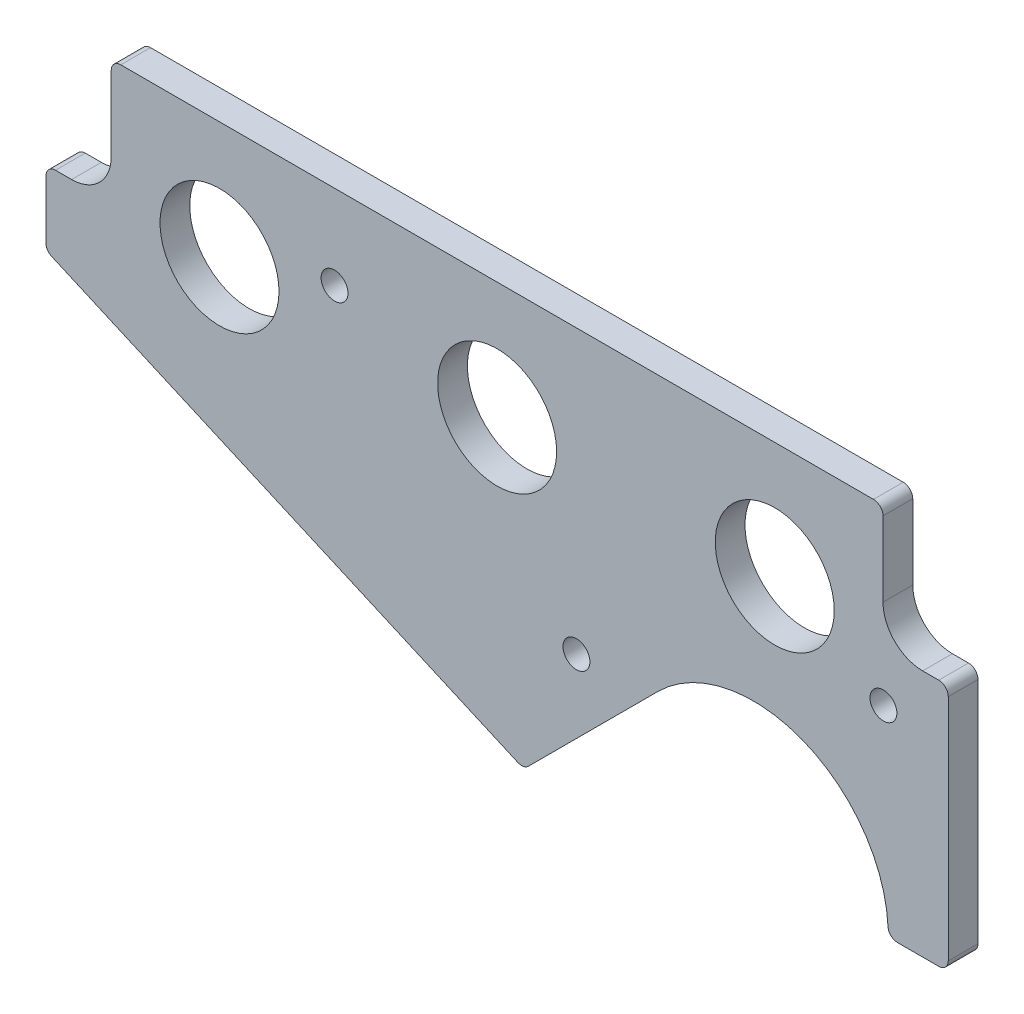
ISO-10303-21;
HEADER;
FILE_DESCRIPTION(('STEP AP214'),'2;1');
FILE_NAME('part.step','',(''),(''),'','','');
FILE_SCHEMA(('AUTOMOTIVE_DESIGN { 1 0 10303 214 1 1 1 1 }'));
ENDSEC;
DATA;
#1=APPLICATION_CONTEXT('core data for automotive mechanical design processes');
#2=APPLICATION_PROTOCOL_DEFINITION('international standard','automotive_design',2000,#1);
#3=PRODUCT_CONTEXT('',#1,'mechanical');
#4=PRODUCT('Part','Part','',(#3));
#5=PRODUCT_RELATED_PRODUCT_CATEGORY('part','',(#4));
#6=PRODUCT_DEFINITION_FORMATION('','',#4);
#7=PRODUCT_DEFINITION_CONTEXT('part definition',#1,'design');
#8=PRODUCT_DEFINITION('design','',#6,#7);
#9=PRODUCT_DEFINITION_SHAPE('','',#8);
#10=(LENGTH_UNIT() NAMED_UNIT(*) SI_UNIT(.MILLI.,.METRE.));
#11=(NAMED_UNIT(*) PLANE_ANGLE_UNIT() SI_UNIT($,.RADIAN.));
#12=(NAMED_UNIT(*) SI_UNIT($,.STERADIAN.) SOLID_ANGLE_UNIT());
#13=UNCERTAINTY_MEASURE_WITH_UNIT(LENGTH_MEASURE(1.E-05),#10,'distance_accuracy_value','');
#14=(GEOMETRIC_REPRESENTATION_CONTEXT(3) GLOBAL_UNCERTAINTY_ASSIGNED_CONTEXT((#13)) GLOBAL_UNIT_ASSIGNED_CONTEXT((#10,
#11,#12)) REPRESENTATION_CONTEXT('',''));
#15=CARTESIAN_POINT('',(0.,0.,0.));
#16=DIRECTION('',(0.,0.,1.));
#17=DIRECTION('',(1.,0.,0.));
#18=AXIS2_PLACEMENT_3D('',#15,#16,#17);
#19=CARTESIAN_POINT('',(-842.127056946519,5944.5822876227,-29.6686860778708));
#20=DIRECTION('',(0.,0.,-1.));
#21=DIRECTION('',(-1.,0.,0.));
#22=AXIS2_PLACEMENT_3D('',#19,#20,#21);
#23=CYLINDRICAL_SURFACE('',#22,1.52399999999986);
#24=CARTESIAN_POINT('',(-842.127056946519,5944.5822876227,-34.4311860778708));
#25=DIRECTION('',(0.,0.,1.));
#26=DIRECTION('',(1.,0.,0.));
#27=AXIS2_PLACEMENT_3D('',#24,#25,#26);
#28=CIRCLE('',#27,1.52399999999986);
#29=CARTESIAN_POINT('',(-840.603056946519,5944.5822876227,-34.4311860778708));
#30=VERTEX_POINT('',#29);
#31=CARTESIAN_POINT('',(-842.127056946519,5946.1062876227,-34.4311860778708));
#32=VERTEX_POINT('',#31);
#33=EDGE_CURVE('E206',#30,#32,#28,.T.);
#34=ORIENTED_EDGE('',*,*,#33,.T.);
#35=DIRECTION('',(0.,0.,-1.));
#36=VECTOR('',#35,1.);
#37=CARTESIAN_POINT('',(-842.127056946519,5946.1062876227,-29.6686860778708));
#38=LINE('',#37,#36);
#39=CARTESIAN_POINT('',(-842.127056946519,5946.1062876227,-29.6686860778708));
#40=VERTEX_POINT('',#39);
#41=EDGE_CURVE('E11',#40,#32,#38,.T.);
#42=ORIENTED_EDGE('',*,*,#41,.F.);
#43=CARTESIAN_POINT('',(-842.127056946519,5944.5822876227,-29.6686860778708));
#44=DIRECTION('',(0.,0.,1.));
#45=DIRECTION('',(1.,0.,0.));
#46=AXIS2_PLACEMENT_3D('',#43,#44,#45);
#47=CIRCLE('',#46,1.52399999999986);
#48=CARTESIAN_POINT('',(-840.603056946519,5944.5822876227,-29.6686860778708));
#49=VERTEX_POINT('',#48);
#50=EDGE_CURVE('E247',#49,#40,#47,.T.);
#51=ORIENTED_EDGE('',*,*,#50,.F.);
#52=DIRECTION('',(0.,0.,-1.));
#53=VECTOR('',#52,1.);
#54=CARTESIAN_POINT('',(-840.603056946519,5944.5822876227,-29.6686860778708));
#55=LINE('',#54,#53);
#56=EDGE_CURVE('E202',#49,#30,#55,.T.);
#57=ORIENTED_EDGE('',*,*,#56,.T.);
#58=EDGE_LOOP('',(#34,#42,#51,#57));
#59=FACE_BOUND('',#58,.T.);
#60=ADVANCED_FACE('F32',(#59),#23,.T.);
#61=CARTESIAN_POINT('',(-842.127056946519,5946.1062876227,-29.6686860778708));
#62=DIRECTION('',(0.,-1.,0.));
#63=DIRECTION('',(0.,0.,-1.));
#64=AXIS2_PLACEMENT_3D('',#61,#62,#63);
#65=PLANE('',#64);
#66=DIRECTION('',(-1.,0.,0.));
#67=VECTOR('',#66,1.);
#68=CARTESIAN_POINT('',(-842.127056946519,5946.1062876227,-34.4311860778708));
#69=LINE('',#68,#67);
#70=CARTESIAN_POINT('',(-962.650056946519,5946.1062876227,-34.4311860778708));
#71=VERTEX_POINT('',#70);
#72=EDGE_CURVE('E209',#32,#71,#69,.T.);
#73=ORIENTED_EDGE('',*,*,#72,.T.);
#74=DIRECTION('',(0.,0.,-1.));
#75=VECTOR('',#74,1.);
#76=CARTESIAN_POINT('',(-962.650056946519,5946.1062876227,-29.6686860778708));
#77=LINE('',#76,#75);
#78=CARTESIAN_POINT('',(-962.650056946519,5946.1062876227,-29.6686860778708));
#79=VERTEX_POINT('',#78);
#80=EDGE_CURVE('E40',#79,#71,#77,.T.);
#81=ORIENTED_EDGE('',*,*,#80,.F.);
#82=DIRECTION('',(-1.,0.,0.));
#83=VECTOR('',#82,1.);
#84=CARTESIAN_POINT('',(-842.127056946519,5946.1062876227,-29.6686860778708));
#85=LINE('',#84,#83);
#86=EDGE_CURVE('E130',#40,#79,#85,.T.);
#87=ORIENTED_EDGE('',*,*,#86,.F.);
#88=ORIENTED_EDGE('',*,*,#41,.T.);
#89=EDGE_LOOP('',(#73,#81,#87,#88));
#90=FACE_BOUND('',#89,.T.);
#91=ADVANCED_FACE('F371',(#90),#65,.F.);
#92=CARTESIAN_POINT('',(-962.650056946519,5944.5822876227,-29.6686860778708));
#93=DIRECTION('',(0.,0.,-1.));
#94=DIRECTION('',(-1.,0.,0.));
#95=AXIS2_PLACEMENT_3D('',#92,#93,#94);
#96=CYLINDRICAL_SURFACE('',#95,1.52400000000052);
#97=CARTESIAN_POINT('',(-962.650056946519,5944.5822876227,-34.4311860778708));
#98=DIRECTION('',(0.,0.,1.));
#99=DIRECTION('',(1.,0.,0.));
#100=AXIS2_PLACEMENT_3D('',#97,#98,#99);
#101=CIRCLE('',#100,1.52400000000052);
#102=CARTESIAN_POINT('',(-964.174056946519,5944.5822876227,-34.4311860778708));
#103=VERTEX_POINT('',#102);
#104=EDGE_CURVE('E212',#71,#103,#101,.T.);
#105=ORIENTED_EDGE('',*,*,#104,.T.);
#106=DIRECTION('',(0.,0.,-1.));
#107=VECTOR('',#106,1.);
#108=CARTESIAN_POINT('',(-964.174056946519,5944.5822876227,-29.6686860778708));
#109=LINE('',#108,#107);
#110=CARTESIAN_POINT('',(-964.174056946519,5944.5822876227,-29.6686860778708));
#111=VERTEX_POINT('',#110);
#112=EDGE_CURVE('E293',#111,#103,#109,.T.);
#113=ORIENTED_EDGE('',*,*,#112,.F.);
#114=CARTESIAN_POINT('',(-962.650056946519,5944.5822876227,-29.6686860778708));
#115=DIRECTION('',(0.,0.,1.));
#116=DIRECTION('',(1.,0.,0.));
#117=AXIS2_PLACEMENT_3D('',#114,#115,#116);
#118=CIRCLE('',#117,1.52400000000052);
#119=EDGE_CURVE('E301',#79,#111,#118,.T.);
#120=ORIENTED_EDGE('',*,*,#119,.F.);
#121=ORIENTED_EDGE('',*,*,#80,.T.);
#122=EDGE_LOOP('',(#105,#113,#120,#121));
#123=FACE_BOUND('',#122,.T.);
#124=ADVANCED_FACE('F299',(#123),#96,.T.);
#125=CARTESIAN_POINT('',(-964.174056946519,5944.5822876227,-29.6686860778708));
#126=DIRECTION('',(1.,0.,0.));
#127=DIRECTION('',(0.,1.,0.));
#128=AXIS2_PLACEMENT_3D('',#125,#126,#127);
#129=PLANE('',#128);
#130=DIRECTION('',(0.,-1.,0.));
#131=VECTOR('',#130,1.);
#132=CARTESIAN_POINT('',(-964.174056946519,5944.5822876227,-34.4311860778708));
#133=LINE('',#132,#131);
#134=CARTESIAN_POINT('',(-964.174056946519,5932.6125376227,-34.4311860778708));
#135=VERTEX_POINT('',#134);
#136=EDGE_CURVE('E214',#103,#135,#133,.T.);
#137=ORIENTED_EDGE('',*,*,#136,.T.);
#138=DIRECTION('',(0.,0.,-1.));
#139=VECTOR('',#138,1.);
#140=CARTESIAN_POINT('',(-964.174056946519,5932.6125376227,-29.6686860778708));
#141=LINE('',#140,#139);
#142=CARTESIAN_POINT('',(-964.174056946519,5932.6125376227,-29.6686860778708));
#143=VERTEX_POINT('',#142);
#144=EDGE_CURVE('E290',#143,#135,#141,.T.);
#145=ORIENTED_EDGE('',*,*,#144,.F.);
#146=DIRECTION('',(0.,-1.,0.));
#147=VECTOR('',#146,1.);
#148=CARTESIAN_POINT('',(-964.174056946519,5944.5822876227,-29.6686860778708));
#149=LINE('',#148,#147);
#150=EDGE_CURVE('E319',#111,#143,#149,.T.);
#151=ORIENTED_EDGE('',*,*,#150,.F.);
#152=ORIENTED_EDGE('',*,*,#112,.T.);
#153=EDGE_LOOP('',(#137,#145,#151,#152));
#154=FACE_BOUND('',#153,.T.);
#155=ADVANCED_FACE('F310',(#154),#129,.F.);
#156=CARTESIAN_POINT('',(-970.524056946519,5932.6125376227,-29.6686860778708));
#157=DIRECTION('',(0.,0.,-1.));
#158=DIRECTION('',(-1.,0.,0.));
#159=AXIS2_PLACEMENT_3D('',#156,#157,#158);
#160=CYLINDRICAL_SURFACE('',#159,6.35000000000008);
#161=CARTESIAN_POINT('',(-970.524056946519,5932.6125376227,-34.4311860778708));
#162=DIRECTION('',(0.,0.,-1.));
#163=DIRECTION('',(1.,0.,0.));
#164=AXIS2_PLACEMENT_3D('',#161,#162,#163);
#165=CIRCLE('',#164,6.35000000000008);
#166=CARTESIAN_POINT('',(-970.524056946519,5926.2625376227,-34.4311860778708));
#167=VERTEX_POINT('',#166);
#168=EDGE_CURVE('E216',#135,#167,#165,.T.);
#169=ORIENTED_EDGE('',*,*,#168,.T.);
#170=DIRECTION('',(0.,0.,-1.));
#171=VECTOR('',#170,1.);
#172=CARTESIAN_POINT('',(-970.524056946519,5926.2625376227,-29.6686860778708));
#173=LINE('',#172,#171);
#174=CARTESIAN_POINT('',(-970.524056946519,5926.2625376227,-29.6686860778708));
#175=VERTEX_POINT('',#174);
#176=EDGE_CURVE('E287',#175,#167,#173,.T.);
#177=ORIENTED_EDGE('',*,*,#176,.F.);
#178=CARTESIAN_POINT('',(-970.524056946519,5932.6125376227,-29.6686860778708));
#179=DIRECTION('',(0.,0.,-1.));
#180=DIRECTION('',(1.,0.,0.));
#181=AXIS2_PLACEMENT_3D('',#178,#179,#180);
#182=CIRCLE('',#181,6.35000000000008);
#183=EDGE_CURVE('E316',#143,#175,#182,.T.);
#184=ORIENTED_EDGE('',*,*,#183,.F.);
#185=ORIENTED_EDGE('',*,*,#144,.T.);
#186=EDGE_LOOP('',(#169,#177,#184,#185));
#187=FACE_BOUND('',#186,.T.);
#188=ADVANCED_FACE('F314',(#187),#160,.F.);
#189=CARTESIAN_POINT('',(-970.524056946519,5926.2625376227,-29.6686860778708));
#190=DIRECTION('',(0.,-1.,0.));
#191=DIRECTION('',(0.,0.,-1.));
#192=AXIS2_PLACEMENT_3D('',#189,#190,#191);
#193=PLANE('',#192);
#194=DIRECTION('',(-1.,0.,0.));
#195=VECTOR('',#194,1.);
#196=CARTESIAN_POINT('',(-970.524056946519,5926.2625376227,-34.4311860778708));
#197=LINE('',#196,#195);
#198=CARTESIAN_POINT('',(-973.095806946519,5926.2625376227,-34.4311860778708));
#199=VERTEX_POINT('',#198);
#200=EDGE_CURVE('E218',#167,#199,#197,.T.);
#201=ORIENTED_EDGE('',*,*,#200,.T.);
#202=DIRECTION('',(0.,0.,-1.));
#203=VECTOR('',#202,1.);
#204=CARTESIAN_POINT('',(-973.095806946519,5926.2625376227,-29.6686860778708));
#205=LINE('',#204,#203);
#206=CARTESIAN_POINT('',(-973.095806946519,5926.2625376227,-29.6686860778708));
#207=VERTEX_POINT('',#206);
#208=EDGE_CURVE('E284',#207,#199,#205,.T.);
#209=ORIENTED_EDGE('',*,*,#208,.F.);
#210=DIRECTION('',(-1.,0.,0.));
#211=VECTOR('',#210,1.);
#212=CARTESIAN_POINT('',(-970.524056946519,5926.2625376227,-29.6686860778708));
#213=LINE('',#212,#211);
#214=EDGE_CURVE('E318',#175,#207,#213,.T.);
#215=ORIENTED_EDGE('',*,*,#214,.F.);
#216=ORIENTED_EDGE('',*,*,#176,.T.);
#217=EDGE_LOOP('',(#201,#209,#215,#216));
#218=FACE_BOUND('',#217,.T.);
#219=ADVANCED_FACE('F384',(#218),#193,.F.);
#220=CARTESIAN_POINT('',(-973.095806946519,5924.7385376227,-29.6686860778708));
#221=DIRECTION('',(0.,0.,-1.));
#222=DIRECTION('',(-1.,0.,0.));
#223=AXIS2_PLACEMENT_3D('',#220,#221,#222);
#224=CYLINDRICAL_SURFACE('',#223,1.52399999999986);
#225=CARTESIAN_POINT('',(-973.095806946519,5924.7385376227,-34.4311860778708));
#226=DIRECTION('',(0.,0.,1.));
#227=DIRECTION('',(1.,0.,0.));
#228=AXIS2_PLACEMENT_3D('',#225,#226,#227);
#229=CIRCLE('',#228,1.52399999999986);
#230=CARTESIAN_POINT('',(-974.619806946519,5924.7385376227,-34.4311860778708));
#231=VERTEX_POINT('',#230);
#232=EDGE_CURVE('E220',#199,#231,#229,.T.);
#233=ORIENTED_EDGE('',*,*,#232,.T.);
#234=DIRECTION('',(0.,0.,-1.));
#235=VECTOR('',#234,1.);
#236=CARTESIAN_POINT('',(-974.619806946519,5924.7385376227,-29.6686860778708));
#237=LINE('',#236,#235);
#238=CARTESIAN_POINT('',(-974.619806946519,5924.7385376227,-29.6686860778708));
#239=VERTEX_POINT('',#238);
#240=EDGE_CURVE('E281',#239,#231,#237,.T.);
#241=ORIENTED_EDGE('',*,*,#240,.F.);
#242=CARTESIAN_POINT('',(-973.095806946519,5924.7385376227,-29.6686860778708));
#243=DIRECTION('',(0.,0.,1.));
#244=DIRECTION('',(1.,0.,0.));
#245=AXIS2_PLACEMENT_3D('',#242,#243,#244);
#246=CIRCLE('',#245,1.52399999999986);
#247=EDGE_CURVE('E321',#207,#239,#246,.T.);
#248=ORIENTED_EDGE('',*,*,#247,.F.);
#249=ORIENTED_EDGE('',*,*,#208,.T.);
#250=EDGE_LOOP('',(#233,#241,#248,#249));
#251=FACE_BOUND('',#250,.T.);
#252=ADVANCED_FACE('F387',(#251),#224,.T.);
#253=CARTESIAN_POINT('',(-974.619806946519,5924.7385376227,-29.6686860778708));
#254=DIRECTION('',(1.,0.,0.));
#255=DIRECTION('',(0.,1.,0.));
#256=AXIS2_PLACEMENT_3D('',#253,#254,#255);
#257=PLANE('',#256);
#258=DIRECTION('',(0.,-1.,0.));
#259=VECTOR('',#258,1.);
#260=CARTESIAN_POINT('',(-974.619806946519,5924.7385376227,-34.4311860778708));
#261=LINE('',#260,#259);
#262=CARTESIAN_POINT('',(-974.619806946519,5915.39241590532,-34.4311860778708));
#263=VERTEX_POINT('',#262);
#264=EDGE_CURVE('E222',#231,#263,#261,.T.);
#265=ORIENTED_EDGE('',*,*,#264,.T.);
#266=DIRECTION('',(0.,0.,-1.));
#267=VECTOR('',#266,1.);
#268=CARTESIAN_POINT('',(-974.619806946519,5915.39241590532,-29.6686860778708));
#269=LINE('',#268,#267);
#270=CARTESIAN_POINT('',(-974.619806946519,5915.39241590532,-29.6686860778708));
#271=VERTEX_POINT('',#270);
#272=EDGE_CURVE('E278',#271,#263,#269,.T.);
#273=ORIENTED_EDGE('',*,*,#272,.F.);
#274=DIRECTION('',(0.,-1.,0.));
#275=VECTOR('',#274,1.);
#276=CARTESIAN_POINT('',(-974.619806946519,5924.7385376227,-29.6686860778708));
#277=LINE('',#276,#275);
#278=EDGE_CURVE('E327',#239,#271,#277,.T.);
#279=ORIENTED_EDGE('',*,*,#278,.F.);
#280=ORIENTED_EDGE('',*,*,#240,.T.);
#281=EDGE_LOOP('',(#265,#273,#279,#280));
#282=FACE_BOUND('',#281,.T.);
#283=ADVANCED_FACE('F391',(#282),#257,.F.);
#284=CARTESIAN_POINT('',(-973.095806946519,5915.39241590532,-29.6686860778708));
#285=DIRECTION('',(0.,0.,-1.));
#286=DIRECTION('',(-1.,0.,0.));
#287=AXIS2_PLACEMENT_3D('',#284,#285,#286);
#288=CYLINDRICAL_SURFACE('',#287,1.52400000000021);
#289=CARTESIAN_POINT('',(-973.095806946519,5915.39241590532,-34.4311860778708));
#290=DIRECTION('',(0.,0.,1.));
#291=DIRECTION('',(1.,0.,0.));
#292=AXIS2_PLACEMENT_3D('',#289,#290,#291);
#293=CIRCLE('',#292,1.52400000000021);
#294=CARTESIAN_POINT('',(-973.70958059466,5913.9974757959,-34.4311860778708));
#295=VERTEX_POINT('',#294);
#296=EDGE_CURVE('E224',#263,#295,#293,.T.);
#297=ORIENTED_EDGE('',*,*,#296,.T.);
#298=DIRECTION('',(0.,0.,-1.));
#299=VECTOR('',#298,1.);
#300=CARTESIAN_POINT('',(-973.70958059466,5913.9974757959,-29.6686860778708));
#301=LINE('',#300,#299);
#302=CARTESIAN_POINT('',(-973.70958059466,5913.9974757959,-29.6686860778708));
#303=VERTEX_POINT('',#302);
#304=EDGE_CURVE('E275',#303,#295,#301,.T.);
#305=ORIENTED_EDGE('',*,*,#304,.F.);
#306=CARTESIAN_POINT('',(-973.095806946519,5915.39241590532,-29.6686860778708));
#307=DIRECTION('',(0.,0.,1.));
#308=DIRECTION('',(1.,0.,0.));
#309=AXIS2_PLACEMENT_3D('',#306,#307,#308);
#310=CIRCLE('',#309,1.52400000000021);
#311=EDGE_CURVE('E329',#271,#303,#310,.T.);
#312=ORIENTED_EDGE('',*,*,#311,.F.);
#313=ORIENTED_EDGE('',*,*,#272,.T.);
#314=EDGE_LOOP('',(#297,#305,#312,#313));
#315=FACE_BOUND('',#314,.T.);
#316=ADVANCED_FACE('F395',(#315),#288,.T.);
#317=CARTESIAN_POINT('',(-973.70958059466,5913.9974757959,-29.6686860778708));
#318=DIRECTION('',(0.40273861426601,0.915315032422768,0.));
#319=DIRECTION('',(-0.915315032422768,0.40273861426601,0.));
#320=AXIS2_PLACEMENT_3D('',#317,#318,#319);
#321=PLANE('',#320);
#322=DIRECTION('',(0.915315032422768,-0.40273861426601,0.));
#323=VECTOR('',#322,1.);
#324=CARTESIAN_POINT('',(-973.70958059466,5913.9974757959,-34.4311860778708));
#325=LINE('',#324,#323);
#326=CARTESIAN_POINT('',(-899.073125037771,5881.15743535087,-34.4311860778708));
#327=VERTEX_POINT('',#326);
#328=EDGE_CURVE('E226',#295,#327,#325,.T.);
#329=ORIENTED_EDGE('',*,*,#328,.T.);
#330=DIRECTION('',(0.,0.,-1.));
#331=VECTOR('',#330,1.);
#332=CARTESIAN_POINT('',(-899.073125037771,5881.15743535087,-29.6686860778708));
#333=LINE('',#332,#331);
#334=CARTESIAN_POINT('',(-899.073125037771,5881.15743535087,-29.6686860778708));
#335=VERTEX_POINT('',#334);
#336=EDGE_CURVE('E272',#335,#327,#333,.T.);
#337=ORIENTED_EDGE('',*,*,#336,.F.);
#338=DIRECTION('',(0.915315032422768,-0.40273861426601,0.));
#339=VECTOR('',#338,1.);
#340=CARTESIAN_POINT('',(-973.70958059466,5913.9974757959,-29.6686860778708));
#341=LINE('',#340,#339);
#342=EDGE_CURVE('E331',#303,#335,#341,.T.);
#343=ORIENTED_EDGE('',*,*,#342,.F.);
#344=ORIENTED_EDGE('',*,*,#304,.T.);
#345=EDGE_LOOP('',(#329,#337,#343,#344));
#346=FACE_BOUND('',#345,.T.);
#347=ADVANCED_FACE('F399',(#346),#321,.F.);
#348=CARTESIAN_POINT('',(-898.459351389629,5882.55237546029,-29.6686860778708));
#349=DIRECTION('',(0.,0.,-1.));
#350=DIRECTION('',(-1.,0.,0.));
#351=AXIS2_PLACEMENT_3D('',#348,#349,#350);
#352=CYLINDRICAL_SURFACE('',#351,1.52399999999978);
#353=CARTESIAN_POINT('',(-898.459351389629,5882.55237546029,-34.4311860778708));
#354=DIRECTION('',(0.,0.,1.));
#355=DIRECTION('',(1.,0.,0.));
#356=AXIS2_PLACEMENT_3D('',#353,#354,#355);
#357=CIRCLE('',#356,1.52399999999978);
#358=CARTESIAN_POINT('',(-897.381720655101,5881.47474472576,-34.4311860778708));
#359=VERTEX_POINT('',#358);
#360=EDGE_CURVE('E228',#327,#359,#357,.T.);
#361=ORIENTED_EDGE('',*,*,#360,.T.);
#362=DIRECTION('',(0.,0.,-1.));
#363=VECTOR('',#362,1.);
#364=CARTESIAN_POINT('',(-897.381720655101,5881.47474472576,-29.6686860778708));
#365=LINE('',#364,#363);
#366=CARTESIAN_POINT('',(-897.381720655101,5881.47474472576,-29.6686860778708));
#367=VERTEX_POINT('',#366);
#368=EDGE_CURVE('E269',#367,#359,#365,.T.);
#369=ORIENTED_EDGE('',*,*,#368,.F.);
#370=CARTESIAN_POINT('',(-898.459351389629,5882.55237546029,-29.6686860778708));
#371=DIRECTION('',(0.,0.,1.));
#372=DIRECTION('',(1.,0.,0.));
#373=AXIS2_PLACEMENT_3D('',#370,#371,#372);
#374=CIRCLE('',#373,1.52399999999978);
#375=EDGE_CURVE('E333',#335,#367,#374,.T.);
#376=ORIENTED_EDGE('',*,*,#375,.F.);
#377=ORIENTED_EDGE('',*,*,#336,.T.);
#378=EDGE_LOOP('',(#361,#369,#376,#377));
#379=FACE_BOUND('',#378,.T.);
#380=ADVANCED_FACE('F403',(#379),#352,.T.);
#381=CARTESIAN_POINT('',(-897.381720655101,5881.47474472576,-29.6686860778708));
#382=DIRECTION('',(-0.707106781186546,0.707106781186549,0.));
#383=DIRECTION('',(-0.707106781186549,-0.707106781186546,0.));
#384=AXIS2_PLACEMENT_3D('',#381,#382,#383);
#385=PLANE('',#384);
#386=DIRECTION('',(0.70710678118655,0.707106781186546,0.));
#387=VECTOR('',#386,1.);
#388=CARTESIAN_POINT('',(-897.381720655101,5881.47474472576,-34.4311860778708));
#389=LINE('',#388,#387);
#390=CARTESIAN_POINT('',(-876.633992352336,5902.22247302852,-34.4311860778708));
#391=VERTEX_POINT('',#390);
#392=EDGE_CURVE('E230',#359,#391,#389,.T.);
#393=ORIENTED_EDGE('',*,*,#392,.T.);
#394=DIRECTION('',(0.,0.,-1.));
#395=VECTOR('',#394,1.);
#396=CARTESIAN_POINT('',(-876.633992352336,5902.22247302852,-29.6686860778708));
#397=LINE('',#396,#395);
#398=CARTESIAN_POINT('',(-876.633992352336,5902.22247302852,-29.6686860778708));
#399=VERTEX_POINT('',#398);
#400=EDGE_CURVE('E266',#399,#391,#397,.T.);
#401=ORIENTED_EDGE('',*,*,#400,.F.);
#402=DIRECTION('',(0.70710678118655,0.707106781186546,0.));
#403=VECTOR('',#402,1.);
#404=CARTESIAN_POINT('',(-897.381720655101,5881.47474472576,-29.6686860778708));
#405=LINE('',#404,#403);
#406=EDGE_CURVE('E335',#367,#399,#405,.T.);
#407=ORIENTED_EDGE('',*,*,#406,.F.);
#408=ORIENTED_EDGE('',*,*,#368,.T.);
#409=EDGE_LOOP('',(#393,#401,#407,#408));
#410=FACE_BOUND('',#409,.T.);
#411=ADVANCED_FACE('F407',(#410),#385,.F.);
#412=CARTESIAN_POINT('',(-861.367556946519,5886.9560376227,-29.6686860778708));
#413=DIRECTION('',(0.,0.,-1.));
#414=DIRECTION('',(-1.,0.,0.));
#415=AXIS2_PLACEMENT_3D('',#412,#413,#414);
#416=CYLINDRICAL_SURFACE('',#415,21.5899999999999);
#417=CARTESIAN_POINT('',(-861.367556946519,5886.9560376227,-34.4311860778708));
#418=DIRECTION('',(0.,0.,-1.));
#419=DIRECTION('',(1.,0.,0.));
#420=AXIS2_PLACEMENT_3D('',#417,#418,#419);
#421=CIRCLE('',#420,21.5899999999999);
#422=CARTESIAN_POINT('',(-839.803970731283,5888.02367498534,-34.4311860778708));
#423=VERTEX_POINT('',#422);
#424=EDGE_CURVE('E232',#391,#423,#421,.T.);
#425=ORIENTED_EDGE('',*,*,#424,.T.);
#426=DIRECTION('',(0.,0.,-1.));
#427=VECTOR('',#426,1.);
#428=CARTESIAN_POINT('',(-839.803970731283,5888.02367498534,-29.6686860778708));
#429=LINE('',#428,#427);
#430=CARTESIAN_POINT('',(-839.803970731283,5888.02367498534,-29.6686860778708));
#431=VERTEX_POINT('',#430);
#432=EDGE_CURVE('E263',#431,#423,#429,.T.);
#433=ORIENTED_EDGE('',*,*,#432,.F.);
#434=CARTESIAN_POINT('',(-861.367556946519,5886.9560376227,-29.6686860778708));
#435=DIRECTION('',(0.,0.,-1.));
#436=DIRECTION('',(1.,0.,0.));
#437=AXIS2_PLACEMENT_3D('',#434,#435,#436);
#438=CIRCLE('',#437,21.5899999999999);
#439=EDGE_CURVE('E337',#399,#431,#438,.T.);
#440=ORIENTED_EDGE('',*,*,#439,.F.);
#441=ORIENTED_EDGE('',*,*,#400,.T.);
#442=EDGE_LOOP('',(#425,#433,#440,#441));
#443=FACE_BOUND('',#442,.T.);
#444=ADVANCED_FACE('F411',(#443),#416,.F.);
#445=CARTESIAN_POINT('',(-838.281835233737,5888.0990376227,-29.6686860778708));
#446=DIRECTION('',(0.,0.,-1.));
#447=DIRECTION('',(-1.,0.,0.));
#448=AXIS2_PLACEMENT_3D('',#445,#446,#447);
#449=CYLINDRICAL_SURFACE('',#448,1.52399999999995);
#450=CARTESIAN_POINT('',(-838.281835233737,5888.0990376227,-34.4311860778708));
#451=DIRECTION('',(0.,0.,1.));
#452=DIRECTION('',(1.,0.,0.));
#453=AXIS2_PLACEMENT_3D('',#450,#451,#452);
#454=CIRCLE('',#453,1.52399999999995);
#455=CARTESIAN_POINT('',(-838.281835233737,5886.5750376227,-34.4311860778708));
#456=VERTEX_POINT('',#455);
#457=EDGE_CURVE('E234',#423,#456,#454,.T.);
#458=ORIENTED_EDGE('',*,*,#457,.T.);
#459=DIRECTION('',(0.,0.,-1.));
#460=VECTOR('',#459,1.);
#461=CARTESIAN_POINT('',(-838.281835233737,5886.5750376227,-29.6686860778708));
#462=LINE('',#461,#460);
#463=CARTESIAN_POINT('',(-838.281835233737,5886.5750376227,-29.6686860778708));
#464=VERTEX_POINT('',#463);
#465=EDGE_CURVE('E260',#464,#456,#462,.T.);
#466=ORIENTED_EDGE('',*,*,#465,.F.);
#467=CARTESIAN_POINT('',(-838.281835233737,5888.0990376227,-29.6686860778708));
#468=DIRECTION('',(0.,0.,1.));
#469=DIRECTION('',(1.,0.,0.));
#470=AXIS2_PLACEMENT_3D('',#467,#468,#469);
#471=CIRCLE('',#470,1.52399999999995);
#472=EDGE_CURVE('E339',#431,#464,#471,.T.);
#473=ORIENTED_EDGE('',*,*,#472,.F.);
#474=ORIENTED_EDGE('',*,*,#432,.T.);
#475=EDGE_LOOP('',(#458,#466,#473,#474));
#476=FACE_BOUND('',#475,.T.);
#477=ADVANCED_FACE('F415',(#476),#449,.T.);
#478=CARTESIAN_POINT('',(-838.281835233737,5886.5750376227,-29.6686860778708));
#479=DIRECTION('',(0.,1.,0.));
#480=DIRECTION('',(0.,0.,1.));
#481=AXIS2_PLACEMENT_3D('',#478,#479,#480);
#482=PLANE('',#481);
#483=DIRECTION('',(1.,0.,0.));
#484=VECTOR('',#483,1.);
#485=CARTESIAN_POINT('',(-838.281835233737,5886.5750376227,-34.4311860778708));
#486=LINE('',#485,#484);
#487=CARTESIAN_POINT('',(-831.681306946519,5886.5750376227,-34.4311860778708));
#488=VERTEX_POINT('',#487);
#489=EDGE_CURVE('E236',#456,#488,#486,.T.);
#490=ORIENTED_EDGE('',*,*,#489,.T.);
#491=DIRECTION('',(0.,0.,-1.));
#492=VECTOR('',#491,1.);
#493=CARTESIAN_POINT('',(-831.681306946519,5886.5750376227,-29.6686860778708));
#494=LINE('',#493,#492);
#495=CARTESIAN_POINT('',(-831.681306946519,5886.5750376227,-29.6686860778708));
#496=VERTEX_POINT('',#495);
#497=EDGE_CURVE('E257',#496,#488,#494,.T.);
#498=ORIENTED_EDGE('',*,*,#497,.F.);
#499=DIRECTION('',(1.,0.,0.));
#500=VECTOR('',#499,1.);
#501=CARTESIAN_POINT('',(-838.281835233737,5886.5750376227,-29.6686860778708));
#502=LINE('',#501,#500);
#503=EDGE_CURVE('E341',#464,#496,#502,.T.);
#504=ORIENTED_EDGE('',*,*,#503,.F.);
#505=ORIENTED_EDGE('',*,*,#465,.T.);
#506=EDGE_LOOP('',(#490,#498,#504,#505));
#507=FACE_BOUND('',#506,.T.);
#508=ADVANCED_FACE('F419',(#507),#482,.F.);
#509=CARTESIAN_POINT('',(-831.681306946519,5888.0990376227,-29.6686860778708));
#510=DIRECTION('',(0.,0.,-1.));
#511=DIRECTION('',(-1.,0.,0.));
#512=AXIS2_PLACEMENT_3D('',#509,#510,#511);
#513=CYLINDRICAL_SURFACE('',#512,1.52399999999986);
#514=CARTESIAN_POINT('',(-831.681306946519,5888.0990376227,-34.4311860778708));
#515=DIRECTION('',(0.,0.,1.));
#516=DIRECTION('',(1.,0.,0.));
#517=AXIS2_PLACEMENT_3D('',#514,#515,#516);
#518=CIRCLE('',#517,1.52399999999986);
#519=CARTESIAN_POINT('',(-830.157306946519,5888.0990376227,-34.4311860778708));
#520=VERTEX_POINT('',#519);
#521=EDGE_CURVE('E238',#488,#520,#518,.T.);
#522=ORIENTED_EDGE('',*,*,#521,.T.);
#523=DIRECTION('',(0.,0.,-1.));
#524=VECTOR('',#523,1.);
#525=CARTESIAN_POINT('',(-830.157306946519,5888.0990376227,-29.6686860778708));
#526=LINE('',#525,#524);
#527=CARTESIAN_POINT('',(-830.157306946519,5888.0990376227,-29.6686860778708));
#528=VERTEX_POINT('',#527);
#529=EDGE_CURVE('E254',#528,#520,#526,.T.);
#530=ORIENTED_EDGE('',*,*,#529,.F.);
#531=CARTESIAN_POINT('',(-831.681306946519,5888.0990376227,-29.6686860778708));
#532=DIRECTION('',(0.,0.,1.));
#533=DIRECTION('',(1.,0.,0.));
#534=AXIS2_PLACEMENT_3D('',#531,#532,#533);
#535=CIRCLE('',#534,1.52399999999986);
#536=EDGE_CURVE('E343',#496,#528,#535,.T.);
#537=ORIENTED_EDGE('',*,*,#536,.F.);
#538=ORIENTED_EDGE('',*,*,#497,.T.);
#539=EDGE_LOOP('',(#522,#530,#537,#538));
#540=FACE_BOUND('',#539,.T.);
#541=ADVANCED_FACE('F423',(#540),#513,.T.);
#542=CARTESIAN_POINT('',(-830.157306946519,5888.0990376227,-29.6686860778708));
#543=DIRECTION('',(-1.,0.,0.));
#544=DIRECTION('',(0.,-1.,0.));
#545=AXIS2_PLACEMENT_3D('',#542,#543,#544);
#546=PLANE('',#545);
#547=DIRECTION('',(0.,1.,0.));
#548=VECTOR('',#547,1.);
#549=CARTESIAN_POINT('',(-830.157306946519,5888.0990376227,-34.4311860778708));
#550=LINE('',#549,#548);
#551=CARTESIAN_POINT('',(-830.157306946518,5924.7385376227,-34.4311860778708));
#552=VERTEX_POINT('',#551);
#553=EDGE_CURVE('E240',#520,#552,#550,.T.);
#554=ORIENTED_EDGE('',*,*,#553,.T.);
#555=DIRECTION('',(0.,0.,-1.));
#556=VECTOR('',#555,1.);
#557=CARTESIAN_POINT('',(-830.157306946518,5924.7385376227,-29.6686860778708));
#558=LINE('',#557,#556);
#559=CARTESIAN_POINT('',(-830.157306946518,5924.7385376227,-29.6686860778708));
#560=VERTEX_POINT('',#559);
#561=EDGE_CURVE('E251',#560,#552,#558,.T.);
#562=ORIENTED_EDGE('',*,*,#561,.F.);
#563=DIRECTION('',(0.,1.,0.));
#564=VECTOR('',#563,1.);
#565=CARTESIAN_POINT('',(-830.157306946519,5888.0990376227,-29.6686860778708));
#566=LINE('',#565,#564);
#567=EDGE_CURVE('E345',#528,#560,#566,.T.);
#568=ORIENTED_EDGE('',*,*,#567,.F.);
#569=ORIENTED_EDGE('',*,*,#529,.T.);
#570=EDGE_LOOP('',(#554,#562,#568,#569));
#571=FACE_BOUND('',#570,.T.);
#572=ADVANCED_FACE('F351',(#571),#546,.F.);
#573=CARTESIAN_POINT('',(-831.681306946519,5924.7385376227,-29.6686860778708));
#574=DIRECTION('',(0.,0.,-1.));
#575=DIRECTION('',(-1.,0.,0.));
#576=AXIS2_PLACEMENT_3D('',#573,#574,#575);
#577=CYLINDRICAL_SURFACE('',#576,1.52400000000036);
#578=CARTESIAN_POINT('',(-831.681306946519,5924.7385376227,-34.4311860778708));
#579=DIRECTION('',(0.,0.,1.));
#580=DIRECTION('',(1.,0.,0.));
#581=AXIS2_PLACEMENT_3D('',#578,#579,#580);
#582=CIRCLE('',#581,1.52400000000036);
#583=CARTESIAN_POINT('',(-831.681306946519,5926.26253762271,-34.4311860778708));
#584=VERTEX_POINT('',#583);
#585=EDGE_CURVE('E242',#552,#584,#582,.T.);
#586=ORIENTED_EDGE('',*,*,#585,.T.);
#587=DIRECTION('',(0.,0.,-1.));
#588=VECTOR('',#587,1.);
#589=CARTESIAN_POINT('',(-831.681306946519,5926.26253762271,-29.6686860778708));
#590=LINE('',#589,#588);
#591=CARTESIAN_POINT('',(-831.681306946519,5926.26253762271,-29.6686860778708));
#592=VERTEX_POINT('',#591);
#593=EDGE_CURVE('E197',#592,#584,#590,.T.);
#594=ORIENTED_EDGE('',*,*,#593,.F.);
#595=CARTESIAN_POINT('',(-831.681306946519,5924.7385376227,-29.6686860778708));
#596=DIRECTION('',(0.,0.,1.));
#597=DIRECTION('',(1.,0.,0.));
#598=AXIS2_PLACEMENT_3D('',#595,#596,#597);
#599=CIRCLE('',#598,1.52400000000036);
#600=EDGE_CURVE('E188',#560,#592,#599,.T.);
#601=ORIENTED_EDGE('',*,*,#600,.F.);
#602=ORIENTED_EDGE('',*,*,#561,.T.);
#603=EDGE_LOOP('',(#586,#594,#601,#602));
#604=FACE_BOUND('',#603,.T.);
#605=ADVANCED_FACE('F355',(#604),#577,.T.);
#606=CARTESIAN_POINT('',(-831.681306946519,5926.26253762271,-29.6686860778708));
#607=DIRECTION('',(3.45359548828699E-13,-1.,0.));
#608=DIRECTION('',(1.,3.45359548828699E-13,0.));
#609=AXIS2_PLACEMENT_3D('',#606,#607,#608);
#610=PLANE('',#609);
#611=DIRECTION('',(-1.,-3.45359548828699E-13,0.));
#612=VECTOR('',#611,1.);
#613=CARTESIAN_POINT('',(-831.681306946519,5926.26253762271,-34.4311860778708));
#614=LINE('',#613,#612);
#615=CARTESIAN_POINT('',(-834.253056946519,5926.2625376227,-34.4311860778708));
#616=VERTEX_POINT('',#615);
#617=EDGE_CURVE('E196',#584,#616,#614,.T.);
#618=ORIENTED_EDGE('',*,*,#617,.T.);
#619=DIRECTION('',(0.,0.,-1.));
#620=VECTOR('',#619,1.);
#621=CARTESIAN_POINT('',(-834.253056946519,5926.2625376227,-29.6686860778708));
#622=LINE('',#621,#620);
#623=CARTESIAN_POINT('',(-834.253056946519,5926.2625376227,-29.6686860778708));
#624=VERTEX_POINT('',#623);
#625=EDGE_CURVE('E193',#624,#616,#622,.T.);
#626=ORIENTED_EDGE('',*,*,#625,.F.);
#627=DIRECTION('',(-1.,-3.45359548828699E-13,0.));
#628=VECTOR('',#627,1.);
#629=CARTESIAN_POINT('',(-831.681306946519,5926.26253762271,-29.6686860778708));
#630=LINE('',#629,#628);
#631=EDGE_CURVE('E182',#592,#624,#630,.T.);
#632=ORIENTED_EDGE('',*,*,#631,.F.);
#633=ORIENTED_EDGE('',*,*,#593,.T.);
#634=EDGE_LOOP('',(#618,#626,#632,#633));
#635=FACE_BOUND('',#634,.T.);
#636=ADVANCED_FACE('F194',(#635),#610,.F.);
#637=CARTESIAN_POINT('',(-834.253056946519,5932.6125376227,-29.6686860778708));
#638=DIRECTION('',(0.,0.,-1.));
#639=DIRECTION('',(-1.,0.,0.));
#640=AXIS2_PLACEMENT_3D('',#637,#638,#639);
#641=CYLINDRICAL_SURFACE('',#640,6.35000000000024);
#642=CARTESIAN_POINT('',(-834.253056946519,5932.6125376227,-34.4311860778708));
#643=DIRECTION('',(0.,0.,-1.));
#644=DIRECTION('',(1.,0.,0.));
#645=AXIS2_PLACEMENT_3D('',#642,#643,#644);
#646=CIRCLE('',#645,6.35000000000024);
#647=CARTESIAN_POINT('',(-840.603056946519,5932.6125376227,-34.4311860778708));
#648=VERTEX_POINT('',#647);
#649=EDGE_CURVE('E116',#616,#648,#646,.T.);
#650=ORIENTED_EDGE('',*,*,#649,.T.);
#651=DIRECTION('',(0.,0.,-1.));
#652=VECTOR('',#651,1.);
#653=CARTESIAN_POINT('',(-840.603056946519,5932.6125376227,-29.6686860778708));
#654=LINE('',#653,#652);
#655=CARTESIAN_POINT('',(-840.603056946519,5932.6125376227,-29.6686860778708));
#656=VERTEX_POINT('',#655);
#657=EDGE_CURVE('E198',#656,#648,#654,.T.);
#658=ORIENTED_EDGE('',*,*,#657,.F.);
#659=CARTESIAN_POINT('',(-834.253056946519,5932.6125376227,-29.6686860778708));
#660=DIRECTION('',(0.,0.,-1.));
#661=DIRECTION('',(1.,0.,0.));
#662=AXIS2_PLACEMENT_3D('',#659,#660,#661);
#663=CIRCLE('',#662,6.35000000000024);
#664=EDGE_CURVE('E186',#624,#656,#663,.T.);
#665=ORIENTED_EDGE('',*,*,#664,.F.);
#666=ORIENTED_EDGE('',*,*,#625,.T.);
#667=EDGE_LOOP('',(#650,#658,#665,#666));
#668=FACE_BOUND('',#667,.T.);
#669=ADVANCED_FACE('F200',(#668),#641,.F.);
#670=CARTESIAN_POINT('',(-840.603056946519,5932.6125376227,-29.6686860778708));
#671=DIRECTION('',(-1.,0.,0.));
#672=DIRECTION('',(0.,-1.,0.));
#673=AXIS2_PLACEMENT_3D('',#670,#671,#672);
#674=PLANE('',#673);
#675=DIRECTION('',(0.,1.,0.));
#676=VECTOR('',#675,1.);
#677=CARTESIAN_POINT('',(-840.603056946519,5932.6125376227,-34.4311860778708));
#678=LINE('',#677,#676);
#679=EDGE_CURVE('E122',#648,#30,#678,.T.);
#680=ORIENTED_EDGE('',*,*,#679,.T.);
#681=ORIENTED_EDGE('',*,*,#56,.F.);
#682=DIRECTION('',(0.,1.,0.));
#683=VECTOR('',#682,1.);
#684=CARTESIAN_POINT('',(-840.603056946519,5932.6125376227,-29.6686860778708));
#685=LINE('',#684,#683);
#686=EDGE_CURVE('E48',#656,#49,#685,.T.);
#687=ORIENTED_EDGE('',*,*,#686,.F.);
#688=ORIENTED_EDGE('',*,*,#657,.T.);
#689=EDGE_LOOP('',(#680,#681,#687,#688));
#690=FACE_BOUND('',#689,.T.);
#691=ADVANCED_FACE('F359',(#690),#674,.F.);
#692=CARTESIAN_POINT('',(-842.127056946519,5944.5822876227,-29.6686860778708));
#693=DIRECTION('',(0.,0.,1.));
#694=DIRECTION('',(1.,0.,0.));
#695=AXIS2_PLACEMENT_3D('',#692,#693,#694);
#696=PLANE('',#695);
#697=CARTESIAN_POINT('',(-946.838556946519,5927.34203762271,-29.6686860778708));
#698=DIRECTION('',(0.,0.,1.));
#699=DIRECTION('',(1.,0.,0.));
#700=AXIS2_PLACEMENT_3D('',#697,#698,#699);
#701=CIRCLE('',#700,9.52500000000005);
#702=CARTESIAN_POINT('',(-937.313556946519,5927.34203762271,-29.6686860778708));
#703=VERTEX_POINT('',#702);
#704=EDGE_CURVE('E529',#703,#703,#701,.T.);
#705=ORIENTED_EDGE('',*,*,#704,.F.);
#706=EDGE_LOOP('',(#705));
#707=FACE_BOUND('',#706,.T.);
#708=CARTESIAN_POINT('',(-902.388556946519,5927.34203762271,-29.6686860778708));
#709=DIRECTION('',(0.,0.,1.));
#710=DIRECTION('',(1.,0.,0.));
#711=AXIS2_PLACEMENT_3D('',#708,#709,#710);
#712=CIRCLE('',#711,9.52500000000005);
#713=CARTESIAN_POINT('',(-892.863556946519,5927.34203762271,-29.6686860778708));
#714=VERTEX_POINT('',#713);
#715=EDGE_CURVE('E531',#714,#714,#712,.T.);
#716=ORIENTED_EDGE('',*,*,#715,.F.);
#717=EDGE_LOOP('',(#716));
#718=FACE_BOUND('',#717,.T.);
#719=CARTESIAN_POINT('',(-857.938556946519,5927.52415359566,-29.6686860778708));
#720=DIRECTION('',(0.,0.,1.));
#721=DIRECTION('',(1.,0.,0.));
#722=AXIS2_PLACEMENT_3D('',#719,#720,#721);
#723=CIRCLE('',#722,9.52500000000005);
#724=CARTESIAN_POINT('',(-848.413556946519,5927.52415359566,-29.6686860778708));
#725=VERTEX_POINT('',#724);
#726=EDGE_CURVE('E537',#725,#725,#723,.T.);
#727=ORIENTED_EDGE('',*,*,#726,.F.);
#728=EDGE_LOOP('',(#727));
#729=FACE_BOUND('',#728,.T.);
#730=CARTESIAN_POINT('',(-840.539556946519,5918.32503762271,-29.6686860778708));
#731=DIRECTION('',(0.,0.,1.));
#732=DIRECTION('',(1.,0.,0.));
#733=AXIS2_PLACEMENT_3D('',#730,#731,#732);
#734=CIRCLE('',#733,2.15264999999998);
#735=CARTESIAN_POINT('',(-838.386906946519,5918.32503762271,-29.6686860778708));
#736=VERTEX_POINT('',#735);
#737=EDGE_CURVE('E543',#736,#736,#734,.T.);
#738=ORIENTED_EDGE('',*,*,#737,.F.);
#739=EDGE_LOOP('',(#738));
#740=FACE_BOUND('',#739,.T.);
#741=CARTESIAN_POINT('',(-889.688556946519,5900.86253762271,-29.6686860778708));
#742=DIRECTION('',(0.,0.,1.));
#743=DIRECTION('',(1.,0.,0.));
#744=AXIS2_PLACEMENT_3D('',#741,#742,#743);
#745=CIRCLE('',#744,2.15264999999998);
#746=CARTESIAN_POINT('',(-887.535906946519,5900.86253762271,-29.6686860778708));
#747=VERTEX_POINT('',#746);
#748=EDGE_CURVE('E551',#747,#747,#745,.T.);
#749=ORIENTED_EDGE('',*,*,#748,.F.);
#750=EDGE_LOOP('',(#749));
#751=FACE_BOUND('',#750,.T.);
#752=CARTESIAN_POINT('',(-928.423556946519,5932.61253762271,-29.6686860778708));
#753=DIRECTION('',(0.,0.,1.));
#754=DIRECTION('',(1.,0.,0.));
#755=AXIS2_PLACEMENT_3D('',#752,#753,#754);
#756=CIRCLE('',#755,2.15264999999998);
#757=CARTESIAN_POINT('',(-926.270906946519,5932.61253762271,-29.6686860778708));
#758=VERTEX_POINT('',#757);
#759=EDGE_CURVE('E557',#758,#758,#756,.T.);
#760=ORIENTED_EDGE('',*,*,#759,.F.);
#761=EDGE_LOOP('',(#760));
#762=FACE_BOUND('',#761,.T.);
#763=ORIENTED_EDGE('',*,*,#50,.T.);
#764=ORIENTED_EDGE('',*,*,#86,.T.);
#765=ORIENTED_EDGE('',*,*,#119,.T.);
#766=ORIENTED_EDGE('',*,*,#150,.T.);
#767=ORIENTED_EDGE('',*,*,#183,.T.);
#768=ORIENTED_EDGE('',*,*,#214,.T.);
#769=ORIENTED_EDGE('',*,*,#247,.T.);
#770=ORIENTED_EDGE('',*,*,#278,.T.);
#771=ORIENTED_EDGE('',*,*,#311,.T.);
#772=ORIENTED_EDGE('',*,*,#342,.T.);
#773=ORIENTED_EDGE('',*,*,#375,.T.);
#774=ORIENTED_EDGE('',*,*,#406,.T.);
#775=ORIENTED_EDGE('',*,*,#439,.T.);
#776=ORIENTED_EDGE('',*,*,#472,.T.);
#777=ORIENTED_EDGE('',*,*,#503,.T.);
#778=ORIENTED_EDGE('',*,*,#536,.T.);
#779=ORIENTED_EDGE('',*,*,#567,.T.);
#780=ORIENTED_EDGE('',*,*,#600,.T.);
#781=ORIENTED_EDGE('',*,*,#631,.T.);
#782=ORIENTED_EDGE('',*,*,#664,.T.);
#783=ORIENTED_EDGE('',*,*,#686,.T.);
#784=EDGE_LOOP('',(#763,#764,#765,#766,#767,#768,#769,#770,#771,#772,#773,#774,#775,#776,#777,
#778,#779,#780,#781,#782,#783));
#785=FACE_BOUND('',#784,.T.);
#786=ADVANCED_FACE('F184',(#707,#718,#729,#740,#751,#762,#785),#696,.T.);
#787=CARTESIAN_POINT('',(-842.127056946519,5944.5822876227,-34.4311860778708));
#788=DIRECTION('',(0.,0.,1.));
#789=DIRECTION('',(1.,0.,0.));
#790=AXIS2_PLACEMENT_3D('',#787,#788,#789);
#791=PLANE('',#790);
#792=CARTESIAN_POINT('',(-946.838556946519,5927.34203762271,-34.4311860778708));
#793=DIRECTION('',(0.,0.,1.));
#794=DIRECTION('',(1.,0.,0.));
#795=AXIS2_PLACEMENT_3D('',#792,#793,#794);
#796=CIRCLE('',#795,9.52500000000005);
#797=CARTESIAN_POINT('',(-937.313556946519,5927.34203762271,-34.4311860778708));
#798=VERTEX_POINT('',#797);
#799=EDGE_CURVE('E526',#798,#798,#796,.T.);
#800=ORIENTED_EDGE('',*,*,#799,.T.);
#801=EDGE_LOOP('',(#800));
#802=FACE_BOUND('',#801,.T.);
#803=CARTESIAN_POINT('',(-902.388556946519,5927.34203762271,-34.4311860778708));
#804=DIRECTION('',(0.,0.,1.));
#805=DIRECTION('',(1.,0.,0.));
#806=AXIS2_PLACEMENT_3D('',#803,#804,#805);
#807=CIRCLE('',#806,9.52500000000005);
#808=CARTESIAN_POINT('',(-892.863556946519,5927.34203762271,-34.4311860778708));
#809=VERTEX_POINT('',#808);
#810=EDGE_CURVE('E534',#809,#809,#807,.T.);
#811=ORIENTED_EDGE('',*,*,#810,.T.);
#812=EDGE_LOOP('',(#811));
#813=FACE_BOUND('',#812,.T.);
#814=CARTESIAN_POINT('',(-857.938556946519,5927.52415359566,-34.4311860778708));
#815=DIRECTION('',(0.,0.,1.));
#816=DIRECTION('',(1.,0.,0.));
#817=AXIS2_PLACEMENT_3D('',#814,#815,#816);
#818=CIRCLE('',#817,9.52500000000005);
#819=CARTESIAN_POINT('',(-848.413556946519,5927.52415359566,-34.4311860778708));
#820=VERTEX_POINT('',#819);
#821=EDGE_CURVE('E540',#820,#820,#818,.T.);
#822=ORIENTED_EDGE('',*,*,#821,.T.);
#823=EDGE_LOOP('',(#822));
#824=FACE_BOUND('',#823,.T.);
#825=CARTESIAN_POINT('',(-840.539556946519,5918.32503762271,-34.4311860778708));
#826=DIRECTION('',(0.,0.,1.));
#827=DIRECTION('',(1.,0.,0.));
#828=AXIS2_PLACEMENT_3D('',#825,#826,#827);
#829=CIRCLE('',#828,2.15264999999998);
#830=CARTESIAN_POINT('',(-838.386906946519,5918.32503762271,-34.4311860778708));
#831=VERTEX_POINT('',#830);
#832=EDGE_CURVE('E548',#831,#831,#829,.T.);
#833=ORIENTED_EDGE('',*,*,#832,.T.);
#834=EDGE_LOOP('',(#833));
#835=FACE_BOUND('',#834,.T.);
#836=CARTESIAN_POINT('',(-889.688556946519,5900.86253762271,-34.4311860778708));
#837=DIRECTION('',(0.,0.,1.));
#838=DIRECTION('',(1.,0.,0.));
#839=AXIS2_PLACEMENT_3D('',#836,#837,#838);
#840=CIRCLE('',#839,2.15264999999998);
#841=CARTESIAN_POINT('',(-887.535906946519,5900.86253762271,-34.4311860778708));
#842=VERTEX_POINT('',#841);
#843=EDGE_CURVE('E554',#842,#842,#840,.T.);
#844=ORIENTED_EDGE('',*,*,#843,.T.);
#845=EDGE_LOOP('',(#844));
#846=FACE_BOUND('',#845,.T.);
#847=CARTESIAN_POINT('',(-928.423556946519,5932.61253762271,-34.4311860778708));
#848=DIRECTION('',(0.,0.,1.));
#849=DIRECTION('',(1.,0.,0.));
#850=AXIS2_PLACEMENT_3D('',#847,#848,#849);
#851=CIRCLE('',#850,2.15264999999998);
#852=CARTESIAN_POINT('',(-926.270906946519,5932.61253762271,-34.4311860778708));
#853=VERTEX_POINT('',#852);
#854=EDGE_CURVE('E210',#853,#853,#851,.T.);
#855=ORIENTED_EDGE('',*,*,#854,.T.);
#856=EDGE_LOOP('',(#855));
#857=FACE_BOUND('',#856,.T.);
#858=ORIENTED_EDGE('',*,*,#33,.F.);
#859=ORIENTED_EDGE('',*,*,#679,.F.);
#860=ORIENTED_EDGE('',*,*,#649,.F.);
#861=ORIENTED_EDGE('',*,*,#617,.F.);
#862=ORIENTED_EDGE('',*,*,#585,.F.);
#863=ORIENTED_EDGE('',*,*,#553,.F.);
#864=ORIENTED_EDGE('',*,*,#521,.F.);
#865=ORIENTED_EDGE('',*,*,#489,.F.);
#866=ORIENTED_EDGE('',*,*,#457,.F.);
#867=ORIENTED_EDGE('',*,*,#424,.F.);
#868=ORIENTED_EDGE('',*,*,#392,.F.);
#869=ORIENTED_EDGE('',*,*,#360,.F.);
#870=ORIENTED_EDGE('',*,*,#328,.F.);
#871=ORIENTED_EDGE('',*,*,#296,.F.);
#872=ORIENTED_EDGE('',*,*,#264,.F.);
#873=ORIENTED_EDGE('',*,*,#232,.F.);
#874=ORIENTED_EDGE('',*,*,#200,.F.);
#875=ORIENTED_EDGE('',*,*,#168,.F.);
#876=ORIENTED_EDGE('',*,*,#136,.F.);
#877=ORIENTED_EDGE('',*,*,#104,.F.);
#878=ORIENTED_EDGE('',*,*,#72,.F.);
#879=EDGE_LOOP('',(#858,#859,#860,#861,#862,#863,#864,#865,#866,#867,#868,#869,#870,#871,#872,
#873,#874,#875,#876,#877,#878));
#880=FACE_BOUND('',#879,.T.);
#881=ADVANCED_FACE('F305',(#802,#813,#824,#835,#846,#857,#880),#791,.F.);
#882=CARTESIAN_POINT('',(-928.423556946519,5932.61253762271,-29.6686860778708));
#883=DIRECTION('',(0.,0.,1.));
#884=DIRECTION('',(1.,0.,0.));
#885=AXIS2_PLACEMENT_3D('',#882,#883,#884);
#886=CYLINDRICAL_SURFACE('',#885,2.15264999999998);
#887=ORIENTED_EDGE('',*,*,#854,.F.);
#888=EDGE_LOOP('',(#887));
#889=FACE_BOUND('',#888,.T.);
#890=ORIENTED_EDGE('',*,*,#759,.T.);
#891=EDGE_LOOP('',(#890));
#892=FACE_BOUND('',#891,.T.);
#893=ADVANCED_FACE('F451',(#889,#892),#886,.F.);
#894=CARTESIAN_POINT('',(-889.688556946519,5900.86253762271,-29.6686860778708));
#895=DIRECTION('',(0.,0.,1.));
#896=DIRECTION('',(1.,0.,0.));
#897=AXIS2_PLACEMENT_3D('',#894,#895,#896);
#898=CYLINDRICAL_SURFACE('',#897,2.15264999999998);
#899=ORIENTED_EDGE('',*,*,#843,.F.);
#900=EDGE_LOOP('',(#899));
#901=FACE_BOUND('',#900,.T.);
#902=ORIENTED_EDGE('',*,*,#748,.T.);
#903=EDGE_LOOP('',(#902));
#904=FACE_BOUND('',#903,.T.);
#905=ADVANCED_FACE('F456',(#901,#904),#898,.F.);
#906=CARTESIAN_POINT('',(-840.539556946519,5918.32503762271,-29.6686860778708));
#907=DIRECTION('',(0.,0.,1.));
#908=DIRECTION('',(1.,0.,0.));
#909=AXIS2_PLACEMENT_3D('',#906,#907,#908);
#910=CYLINDRICAL_SURFACE('',#909,2.15264999999998);
#911=ORIENTED_EDGE('',*,*,#832,.F.);
#912=EDGE_LOOP('',(#911));
#913=FACE_BOUND('',#912,.T.);
#914=ORIENTED_EDGE('',*,*,#737,.T.);
#915=EDGE_LOOP('',(#914));
#916=FACE_BOUND('',#915,.T.);
#917=ADVANCED_FACE('F468',(#913,#916),#910,.F.);
#918=CARTESIAN_POINT('',(-857.938556946519,5927.52415359566,-34.4311860778708));
#919=DIRECTION('',(0.,0.,1.));
#920=DIRECTION('',(1.,0.,0.));
#921=AXIS2_PLACEMENT_3D('',#918,#919,#920);
#922=CYLINDRICAL_SURFACE('',#921,9.52500000000005);
#923=ORIENTED_EDGE('',*,*,#821,.F.);
#924=EDGE_LOOP('',(#923));
#925=FACE_BOUND('',#924,.T.);
#926=ORIENTED_EDGE('',*,*,#726,.T.);
#927=EDGE_LOOP('',(#926));
#928=FACE_BOUND('',#927,.T.);
#929=ADVANCED_FACE('F478',(#925,#928),#922,.F.);
#930=CARTESIAN_POINT('',(-902.388556946519,5927.34203762271,-34.4311860778708));
#931=DIRECTION('',(0.,0.,1.));
#932=DIRECTION('',(1.,0.,0.));
#933=AXIS2_PLACEMENT_3D('',#930,#931,#932);
#934=CYLINDRICAL_SURFACE('',#933,9.52500000000005);
#935=ORIENTED_EDGE('',*,*,#810,.F.);
#936=EDGE_LOOP('',(#935));
#937=FACE_BOUND('',#936,.T.);
#938=ORIENTED_EDGE('',*,*,#715,.T.);
#939=EDGE_LOOP('',(#938));
#940=FACE_BOUND('',#939,.T.);
#941=ADVANCED_FACE('F499',(#937,#940),#934,.F.);
#942=CARTESIAN_POINT('',(-946.838556946519,5927.34203762271,-34.4311860778708));
#943=DIRECTION('',(0.,0.,1.));
#944=DIRECTION('',(1.,0.,0.));
#945=AXIS2_PLACEMENT_3D('',#942,#943,#944);
#946=CYLINDRICAL_SURFACE('',#945,9.52500000000005);
#947=ORIENTED_EDGE('',*,*,#799,.F.);
#948=EDGE_LOOP('',(#947));
#949=FACE_BOUND('',#948,.T.);
#950=ORIENTED_EDGE('',*,*,#704,.T.);
#951=EDGE_LOOP('',(#950));
#952=FACE_BOUND('',#951,.T.);
#953=ADVANCED_FACE('F509',(#949,#952),#946,.F.);
#954=CLOSED_SHELL('',(#60,#91,#124,#155,#188,#219,#252,#283,#316,#347,#380,#411,#444,#477,#508,
#541,#572,#605,#636,#669,#691,#786,#881,#893,#905,#917,#929,#941,#953));
#955=MANIFOLD_SOLID_BREP('B2',#954);
#956=ADVANCED_BREP_SHAPE_REPRESENTATION('',(#18,#955),#14);
#957=SHAPE_DEFINITION_REPRESENTATION(#9,#956);
ENDSEC;
END-ISO-10303-21;
